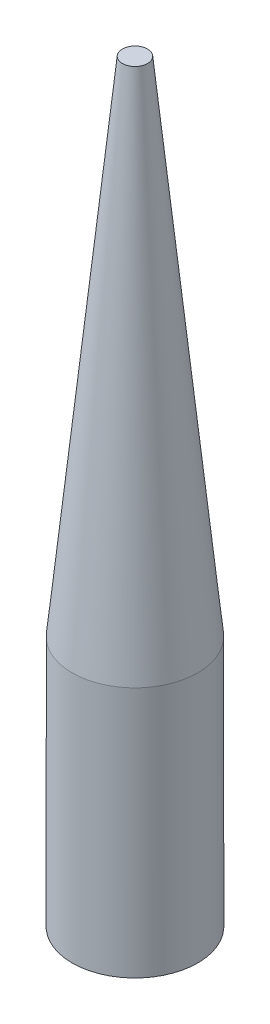
ISO-10303-21;
HEADER;
FILE_DESCRIPTION(('STEP AP214'),'2;1');
FILE_NAME('part.step','',(''),(''),'','','');
FILE_SCHEMA(('AUTOMOTIVE_DESIGN { 1 0 10303 214 1 1 1 1 }'));
ENDSEC;
DATA;
#1=APPLICATION_CONTEXT('core data for automotive mechanical design processes');
#2=APPLICATION_PROTOCOL_DEFINITION('international standard','automotive_design',2000,#1);
#3=PRODUCT_CONTEXT('',#1,'mechanical');
#4=PRODUCT('Part','Part','',(#3));
#5=PRODUCT_RELATED_PRODUCT_CATEGORY('part','',(#4));
#6=PRODUCT_DEFINITION_FORMATION('','',#4);
#7=PRODUCT_DEFINITION_CONTEXT('part definition',#1,'design');
#8=PRODUCT_DEFINITION('design','',#6,#7);
#9=PRODUCT_DEFINITION_SHAPE('','',#8);
#10=(LENGTH_UNIT() NAMED_UNIT(*) SI_UNIT(.MILLI.,.METRE.));
#11=(NAMED_UNIT(*) PLANE_ANGLE_UNIT() SI_UNIT($,.RADIAN.));
#12=(NAMED_UNIT(*) SI_UNIT($,.STERADIAN.) SOLID_ANGLE_UNIT());
#13=UNCERTAINTY_MEASURE_WITH_UNIT(LENGTH_MEASURE(1.E-05),#10,'distance_accuracy_value','');
#14=(GEOMETRIC_REPRESENTATION_CONTEXT(3) GLOBAL_UNCERTAINTY_ASSIGNED_CONTEXT((#13)) GLOBAL_UNIT_ASSIGNED_CONTEXT((#10,
#11,#12)) REPRESENTATION_CONTEXT('',''));
#15=CARTESIAN_POINT('',(0.,0.,0.));
#16=DIRECTION('',(0.,0.,1.));
#17=DIRECTION('',(1.,0.,0.));
#18=AXIS2_PLACEMENT_3D('',#15,#16,#17);
#19=CARTESIAN_POINT('',(0.,10.,0.));
#20=DIRECTION('',(0.,-1.,0.));
#21=DIRECTION('',(0.,0.,-1.));
#22=AXIS2_PLACEMENT_3D('',#19,#20,#21);
#23=CYLINDRICAL_SURFACE('',#22,2.5);
#24=CARTESIAN_POINT('',(0.,10.,0.));
#25=DIRECTION('',(0.,1.,0.));
#26=DIRECTION('',(0.,0.,1.));
#27=AXIS2_PLACEMENT_3D('',#24,#25,#26);
#28=CIRCLE('',#27,2.5);
#29=CARTESIAN_POINT('',(0.,10.,2.5));
#30=VERTEX_POINT('',#29);
#31=EDGE_CURVE('E10',#30,#30,#28,.T.);
#32=ORIENTED_EDGE('',*,*,#31,.F.);
#33=EDGE_LOOP('',(#32));
#34=FACE_BOUND('',#33,.T.);
#35=CARTESIAN_POINT('',(0.,0.,0.));
#36=DIRECTION('',(0.,1.,0.));
#37=DIRECTION('',(0.,0.,1.));
#38=AXIS2_PLACEMENT_3D('',#35,#36,#37);
#39=CIRCLE('',#38,2.5);
#40=CARTESIAN_POINT('',(0.,0.,2.5));
#41=VERTEX_POINT('',#40);
#42=EDGE_CURVE('E34',#41,#41,#39,.T.);
#43=ORIENTED_EDGE('',*,*,#42,.T.);
#44=EDGE_LOOP('',(#43));
#45=FACE_BOUND('',#44,.T.);
#46=ADVANCED_FACE('F31',(#34,#45),#23,.T.);
#47=CARTESIAN_POINT('',(0.,0.,0.));
#48=DIRECTION('',(0.,1.,0.));
#49=DIRECTION('',(0.,0.,1.));
#50=AXIS2_PLACEMENT_3D('',#47,#48,#49);
#51=PLANE('',#50);
#52=ORIENTED_EDGE('',*,*,#42,.F.);
#53=EDGE_LOOP('',(#52));
#54=FACE_BOUND('',#53,.T.);
#55=ADVANCED_FACE('F50',(#54),#51,.F.);
#56=CARTESIAN_POINT('',(0.,30.,0.));
#57=DIRECTION('',(0.,1.,0.));
#58=DIRECTION('',(0.,0.,1.));
#59=AXIS2_PLACEMENT_3D('',#56,#57,#58);
#60=PLANE('',#59);
#61=CARTESIAN_POINT('',(0.,30.,0.));
#62=DIRECTION('',(0.,-1.,0.));
#63=DIRECTION('',(0.,0.,-1.));
#64=AXIS2_PLACEMENT_3D('',#61,#62,#63);
#65=CIRCLE('',#64,0.5);
#66=CARTESIAN_POINT('',(0.,30.,-0.5));
#67=VERTEX_POINT('',#66);
#68=EDGE_CURVE('E41',#67,#67,#65,.T.);
#69=ORIENTED_EDGE('',*,*,#68,.F.);
#70=EDGE_LOOP('',(#69));
#71=FACE_BOUND('',#70,.T.);
#72=ADVANCED_FACE('F48',(#71),#60,.T.);
#73=CARTESIAN_POINT('',(0.,10.,0.));
#74=DIRECTION('',(0.,-1.,0.));
#75=DIRECTION('',(0.,0.,-1.));
#76=AXIS2_PLACEMENT_3D('',#73,#74,#75);
#77=CONICAL_SURFACE('',#76,2.5,0.099668652491162);
#78=ORIENTED_EDGE('',*,*,#68,.T.);
#79=EDGE_LOOP('',(#78));
#80=FACE_BOUND('',#79,.T.);
#81=ORIENTED_EDGE('',*,*,#31,.T.);
#82=EDGE_LOOP('',(#81));
#83=FACE_BOUND('',#82,.T.);
#84=ADVANCED_FACE('F46',(#80,#83),#77,.T.);
#85=CLOSED_SHELL('',(#46,#55,#72,#84));
#86=MANIFOLD_SOLID_BREP('B2',#85);
#87=ADVANCED_BREP_SHAPE_REPRESENTATION('',(#18,#86),#14);
#88=SHAPE_DEFINITION_REPRESENTATION(#9,#87);
ENDSEC;
END-ISO-10303-21;
